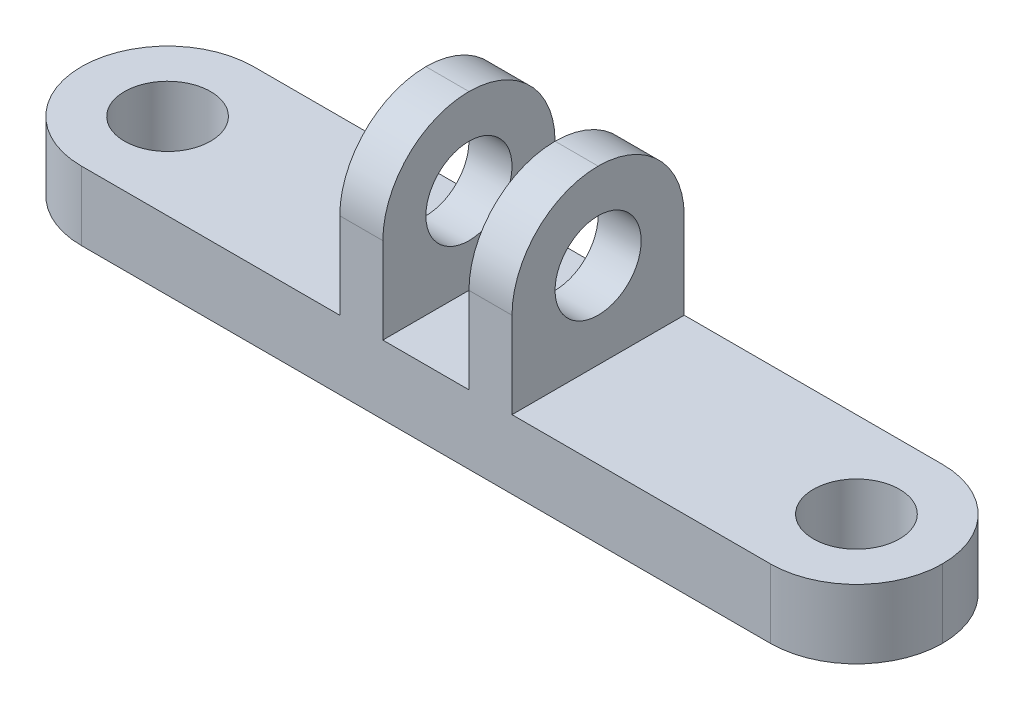
ISO-10303-21;
HEADER;
FILE_DESCRIPTION(('STEP AP214'),'2;1');
FILE_NAME('part.step','',(''),(''),'','','');
FILE_SCHEMA(('AUTOMOTIVE_DESIGN { 1 0 10303 214 1 1 1 1 }'));
ENDSEC;
DATA;
#1=APPLICATION_CONTEXT('core data for automotive mechanical design processes');
#2=APPLICATION_PROTOCOL_DEFINITION('international standard','automotive_design',2000,#1);
#3=PRODUCT_CONTEXT('',#1,'mechanical');
#4=PRODUCT('Part','Part','',(#3));
#5=PRODUCT_RELATED_PRODUCT_CATEGORY('part','',(#4));
#6=PRODUCT_DEFINITION_FORMATION('','',#4);
#7=PRODUCT_DEFINITION_CONTEXT('part definition',#1,'design');
#8=PRODUCT_DEFINITION('design','',#6,#7);
#9=PRODUCT_DEFINITION_SHAPE('','',#8);
#10=(LENGTH_UNIT() NAMED_UNIT(*) SI_UNIT(.MILLI.,.METRE.));
#11=(NAMED_UNIT(*) PLANE_ANGLE_UNIT() SI_UNIT($,.RADIAN.));
#12=(NAMED_UNIT(*) SI_UNIT($,.STERADIAN.) SOLID_ANGLE_UNIT());
#13=UNCERTAINTY_MEASURE_WITH_UNIT(LENGTH_MEASURE(1.E-05),#10,'distance_accuracy_value','');
#14=(GEOMETRIC_REPRESENTATION_CONTEXT(3) GLOBAL_UNCERTAINTY_ASSIGNED_CONTEXT((#13)) GLOBAL_UNIT_ASSIGNED_CONTEXT((#10,
#11,#12)) REPRESENTATION_CONTEXT('',''));
#15=CARTESIAN_POINT('',(0.,0.,0.));
#16=DIRECTION('',(0.,0.,1.));
#17=DIRECTION('',(1.,0.,0.));
#18=AXIS2_PLACEMENT_3D('',#15,#16,#17);
#19=CARTESIAN_POINT('',(0.,2.54,0.));
#20=DIRECTION('',(0.,-1.,0.));
#21=DIRECTION('',(0.,0.,-1.));
#22=AXIS2_PLACEMENT_3D('',#19,#20,#21);
#23=PLANE('',#22);
#24=CARTESIAN_POINT('',(12.7,2.54,0.));
#25=DIRECTION('',(0.,1.,0.));
#26=DIRECTION('',(0.,0.,1.));
#27=AXIS2_PLACEMENT_3D('',#24,#25,#26);
#28=CIRCLE('',#27,1.5875);
#29=CARTESIAN_POINT('',(12.7,2.54,1.5875));
#30=VERTEX_POINT('',#29);
#31=EDGE_CURVE('E228',#30,#30,#28,.T.);
#32=ORIENTED_EDGE('',*,*,#31,.F.);
#33=EDGE_LOOP('',(#32));
#34=FACE_BOUND('',#33,.T.);
#35=CARTESIAN_POINT('',(12.7,2.54,0.));
#36=DIRECTION('',(0.,-1.,0.));
#37=DIRECTION('',(0.,0.,-1.));
#38=AXIS2_PLACEMENT_3D('',#35,#36,#37);
#39=CIRCLE('',#38,3.175);
#40=CARTESIAN_POINT('',(12.7,2.54,3.175));
#41=VERTEX_POINT('',#40);
#42=CARTESIAN_POINT('',(15.875,2.54,0.));
#43=VERTEX_POINT('',#42);
#44=EDGE_CURVE('E306',#41,#43,#39,.F.);
#45=ORIENTED_EDGE('',*,*,#44,.T.);
#46=CARTESIAN_POINT('',(12.7,2.54,0.));
#47=DIRECTION('',(0.,-1.,0.));
#48=DIRECTION('',(0.,0.,-1.));
#49=AXIS2_PLACEMENT_3D('',#46,#47,#48);
#50=CIRCLE('',#49,3.175);
#51=CARTESIAN_POINT('',(12.7,2.54,-3.175));
#52=VERTEX_POINT('',#51);
#53=EDGE_CURVE('E309',#43,#52,#50,.F.);
#54=ORIENTED_EDGE('',*,*,#53,.T.);
#55=DIRECTION('',(-1.,0.,0.));
#56=VECTOR('',#55,1.);
#57=CARTESIAN_POINT('',(-15.875,2.54,-3.175));
#58=LINE('',#57,#56);
#59=CARTESIAN_POINT('',(3.175,2.54,-3.175));
#60=VERTEX_POINT('',#59);
#61=EDGE_CURVE('E184',#52,#60,#58,.T.);
#62=ORIENTED_EDGE('',*,*,#61,.T.);
#63=DIRECTION('',(0.,0.,-1.));
#64=VECTOR('',#63,1.);
#65=CARTESIAN_POINT('',(3.175,2.54,3.175));
#66=LINE('',#65,#64);
#67=CARTESIAN_POINT('',(3.175,2.54,3.175));
#68=VERTEX_POINT('',#67);
#69=EDGE_CURVE('E193',#68,#60,#66,.T.);
#70=ORIENTED_EDGE('',*,*,#69,.F.);
#71=DIRECTION('',(1.,0.,0.));
#72=VECTOR('',#71,1.);
#73=CARTESIAN_POINT('',(-15.875,2.54,3.175));
#74=LINE('',#73,#72);
#75=EDGE_CURVE('E246',#68,#41,#74,.T.);
#76=ORIENTED_EDGE('',*,*,#75,.T.);
#77=EDGE_LOOP('',(#45,#54,#62,#70,#76));
#78=FACE_BOUND('',#77,.T.);
#79=ADVANCED_FACE('F43',(#34,#78),#23,.F.);
#80=DIRECTION('',(0.,0.,1.));
#81=VECTOR('',#80,1.);
#82=CARTESIAN_POINT('',(1.5875,2.54,3.175));
#83=LINE('',#82,#81);
#84=CARTESIAN_POINT('',(1.5875,2.54,-3.175));
#85=VERTEX_POINT('',#84);
#86=CARTESIAN_POINT('',(1.5875,2.54,3.175));
#87=VERTEX_POINT('',#86);
#88=EDGE_CURVE('E165',#85,#87,#83,.T.);
#89=ORIENTED_EDGE('',*,*,#88,.F.);
#90=CARTESIAN_POINT('',(-1.5875,2.54,-3.175));
#91=VERTEX_POINT('',#90);
#92=EDGE_CURVE('E175',#85,#91,#58,.T.);
#93=ORIENTED_EDGE('',*,*,#92,.T.);
#94=DIRECTION('',(0.,0.,-1.));
#95=VECTOR('',#94,1.);
#96=CARTESIAN_POINT('',(-1.5875,2.54,3.175));
#97=LINE('',#96,#95);
#98=CARTESIAN_POINT('',(-1.5875,2.54,3.175));
#99=VERTEX_POINT('',#98);
#100=EDGE_CURVE('E208',#99,#91,#97,.T.);
#101=ORIENTED_EDGE('',*,*,#100,.F.);
#102=EDGE_CURVE('E190',#99,#87,#74,.T.);
#103=ORIENTED_EDGE('',*,*,#102,.T.);
#104=EDGE_LOOP('',(#89,#93,#101,#103));
#105=FACE_BOUND('',#104,.T.);
#106=ADVANCED_FACE('F188',(#105),#23,.F.);
#107=CARTESIAN_POINT('',(-12.7,2.54,0.));
#108=DIRECTION('',(0.,1.,0.));
#109=DIRECTION('',(0.,0.,1.));
#110=AXIS2_PLACEMENT_3D('',#107,#108,#109);
#111=CIRCLE('',#110,1.5875);
#112=CARTESIAN_POINT('',(-12.7,2.54,1.5875));
#113=VERTEX_POINT('',#112);
#114=EDGE_CURVE('E236',#113,#113,#111,.T.);
#115=ORIENTED_EDGE('',*,*,#114,.F.);
#116=EDGE_LOOP('',(#115));
#117=FACE_BOUND('',#116,.T.);
#118=CARTESIAN_POINT('',(-12.7,2.54,0.));
#119=DIRECTION('',(0.,-1.,0.));
#120=DIRECTION('',(0.,0.,-1.));
#121=AXIS2_PLACEMENT_3D('',#118,#119,#120);
#122=CIRCLE('',#121,3.175);
#123=CARTESIAN_POINT('',(-12.7,2.54,-3.175));
#124=VERTEX_POINT('',#123);
#125=CARTESIAN_POINT('',(-15.875,2.54,0.));
#126=VERTEX_POINT('',#125);
#127=EDGE_CURVE('E287',#124,#126,#122,.F.);
#128=ORIENTED_EDGE('',*,*,#127,.T.);
#129=CARTESIAN_POINT('',(-12.7,2.54,0.));
#130=DIRECTION('',(0.,-1.,0.));
#131=DIRECTION('',(0.,0.,-1.));
#132=AXIS2_PLACEMENT_3D('',#129,#130,#131);
#133=CIRCLE('',#132,3.175);
#134=CARTESIAN_POINT('',(-12.7,2.54,3.175));
#135=VERTEX_POINT('',#134);
#136=EDGE_CURVE('E290',#126,#135,#133,.F.);
#137=ORIENTED_EDGE('',*,*,#136,.T.);
#138=CARTESIAN_POINT('',(-3.175,2.54,3.175));
#139=VERTEX_POINT('',#138);
#140=EDGE_CURVE('E244',#135,#139,#74,.T.);
#141=ORIENTED_EDGE('',*,*,#140,.T.);
#142=DIRECTION('',(0.,0.,1.));
#143=VECTOR('',#142,1.);
#144=CARTESIAN_POINT('',(-3.175,2.54,3.175));
#145=LINE('',#144,#143);
#146=CARTESIAN_POINT('',(-3.175,2.54,-3.175));
#147=VERTEX_POINT('',#146);
#148=EDGE_CURVE('E211',#147,#139,#145,.T.);
#149=ORIENTED_EDGE('',*,*,#148,.F.);
#150=EDGE_CURVE('E185',#147,#124,#58,.T.);
#151=ORIENTED_EDGE('',*,*,#150,.T.);
#152=EDGE_LOOP('',(#128,#137,#141,#149,#151));
#153=FACE_BOUND('',#152,.T.);
#154=ADVANCED_FACE('F393',(#117,#153),#23,.F.);
#155=CARTESIAN_POINT('',(0.,0.,0.));
#156=DIRECTION('',(0.,-1.,0.));
#157=DIRECTION('',(0.,0.,-1.));
#158=AXIS2_PLACEMENT_3D('',#155,#156,#157);
#159=PLANE('',#158);
#160=CARTESIAN_POINT('',(-12.7,0.,0.));
#161=DIRECTION('',(0.,1.,0.));
#162=DIRECTION('',(0.,0.,1.));
#163=AXIS2_PLACEMENT_3D('',#160,#161,#162);
#164=CIRCLE('',#163,1.5875);
#165=CARTESIAN_POINT('',(-12.7,0.,1.5875));
#166=VERTEX_POINT('',#165);
#167=EDGE_CURVE('E232',#166,#166,#164,.T.);
#168=ORIENTED_EDGE('',*,*,#167,.T.);
#169=EDGE_LOOP('',(#168));
#170=FACE_BOUND('',#169,.T.);
#171=DIRECTION('',(1.,0.,0.));
#172=VECTOR('',#171,1.);
#173=CARTESIAN_POINT('',(-15.875,0.,3.175));
#174=LINE('',#173,#172);
#175=CARTESIAN_POINT('',(-12.7,0.,3.175));
#176=VERTEX_POINT('',#175);
#177=CARTESIAN_POINT('',(12.7,0.,3.175));
#178=VERTEX_POINT('',#177);
#179=EDGE_CURVE('E240',#176,#178,#174,.T.);
#180=ORIENTED_EDGE('',*,*,#179,.F.);
#181=CARTESIAN_POINT('',(-12.7,0.,0.));
#182=DIRECTION('',(0.,-1.,0.));
#183=DIRECTION('',(0.,0.,-1.));
#184=AXIS2_PLACEMENT_3D('',#181,#182,#183);
#185=CIRCLE('',#184,3.175);
#186=CARTESIAN_POINT('',(-15.875,0.,0.));
#187=VERTEX_POINT('',#186);
#188=EDGE_CURVE('E284',#176,#187,#185,.T.);
#189=ORIENTED_EDGE('',*,*,#188,.T.);
#190=CARTESIAN_POINT('',(-12.7,0.,0.));
#191=DIRECTION('',(0.,-1.,0.));
#192=DIRECTION('',(0.,0.,-1.));
#193=AXIS2_PLACEMENT_3D('',#190,#191,#192);
#194=CIRCLE('',#193,3.175);
#195=CARTESIAN_POINT('',(-12.7,0.,-3.175));
#196=VERTEX_POINT('',#195);
#197=EDGE_CURVE('E281',#187,#196,#194,.T.);
#198=ORIENTED_EDGE('',*,*,#197,.T.);
#199=DIRECTION('',(-1.,0.,0.));
#200=VECTOR('',#199,1.);
#201=CARTESIAN_POINT('',(-15.875,0.,-3.175));
#202=LINE('',#201,#200);
#203=CARTESIAN_POINT('',(12.7,0.,-3.175));
#204=VERTEX_POINT('',#203);
#205=EDGE_CURVE('E253',#204,#196,#202,.T.);
#206=ORIENTED_EDGE('',*,*,#205,.F.);
#207=CARTESIAN_POINT('',(12.7,0.,0.));
#208=DIRECTION('',(0.,-1.,0.));
#209=DIRECTION('',(0.,0.,-1.));
#210=AXIS2_PLACEMENT_3D('',#207,#208,#209);
#211=CIRCLE('',#210,3.175);
#212=CARTESIAN_POINT('',(15.875,0.,0.));
#213=VERTEX_POINT('',#212);
#214=EDGE_CURVE('E278',#204,#213,#211,.T.);
#215=ORIENTED_EDGE('',*,*,#214,.T.);
#216=CARTESIAN_POINT('',(12.7,0.,0.));
#217=DIRECTION('',(0.,-1.,0.));
#218=DIRECTION('',(0.,0.,-1.));
#219=AXIS2_PLACEMENT_3D('',#216,#217,#218);
#220=CIRCLE('',#219,3.175);
#221=EDGE_CURVE('E275',#213,#178,#220,.T.);
#222=ORIENTED_EDGE('',*,*,#221,.T.);
#223=EDGE_LOOP('',(#180,#189,#198,#206,#215,#222));
#224=FACE_BOUND('',#223,.T.);
#225=CARTESIAN_POINT('',(12.7,0.,0.));
#226=DIRECTION('',(0.,1.,0.));
#227=DIRECTION('',(0.,0.,1.));
#228=AXIS2_PLACEMENT_3D('',#225,#226,#227);
#229=CIRCLE('',#228,1.5875);
#230=CARTESIAN_POINT('',(12.7,0.,1.5875));
#231=VERTEX_POINT('',#230);
#232=EDGE_CURVE('E227',#231,#231,#229,.T.);
#233=ORIENTED_EDGE('',*,*,#232,.T.);
#234=EDGE_LOOP('',(#233));
#235=FACE_BOUND('',#234,.T.);
#236=ADVANCED_FACE('F401',(#170,#224,#235),#159,.T.);
#237=CARTESIAN_POINT('',(-15.875,2.54,3.175));
#238=DIRECTION('',(0.,0.,-1.));
#239=DIRECTION('',(-1.,0.,0.));
#240=AXIS2_PLACEMENT_3D('',#237,#238,#239);
#241=PLANE('',#240);
#242=ORIENTED_EDGE('',*,*,#140,.F.);
#243=DIRECTION('',(0.,-1.,0.));
#244=VECTOR('',#243,1.);
#245=CARTESIAN_POINT('',(-12.7,2.54,3.175));
#246=LINE('',#245,#244);
#247=EDGE_CURVE('E271',#135,#176,#246,.T.);
#248=ORIENTED_EDGE('',*,*,#247,.T.);
#249=ORIENTED_EDGE('',*,*,#179,.T.);
#250=DIRECTION('',(0.,-1.,0.));
#251=VECTOR('',#250,1.);
#252=CARTESIAN_POINT('',(12.7,2.54,3.175));
#253=LINE('',#252,#251);
#254=EDGE_CURVE('E268',#178,#41,#253,.F.);
#255=ORIENTED_EDGE('',*,*,#254,.T.);
#256=ORIENTED_EDGE('',*,*,#75,.F.);
#257=DIRECTION('',(0.,-1.,0.));
#258=VECTOR('',#257,1.);
#259=CARTESIAN_POINT('',(3.175,8.89,3.175));
#260=LINE('',#259,#258);
#261=CARTESIAN_POINT('',(3.175,5.715,3.175));
#262=VERTEX_POINT('',#261);
#263=EDGE_CURVE('E192',#262,#68,#260,.T.);
#264=ORIENTED_EDGE('',*,*,#263,.F.);
#265=DIRECTION('',(1.,0.,0.));
#266=VECTOR('',#265,1.);
#267=CARTESIAN_POINT('',(-15.875,5.715,3.175));
#268=LINE('',#267,#266);
#269=CARTESIAN_POINT('',(1.5875,5.715,3.175));
#270=VERTEX_POINT('',#269);
#271=EDGE_CURVE('E264',#262,#270,#268,.F.);
#272=ORIENTED_EDGE('',*,*,#271,.T.);
#273=DIRECTION('',(0.,-1.,0.));
#274=VECTOR('',#273,1.);
#275=CARTESIAN_POINT('',(1.5875,8.89,3.175));
#276=LINE('',#275,#274);
#277=EDGE_CURVE('E172',#270,#87,#276,.T.);
#278=ORIENTED_EDGE('',*,*,#277,.T.);
#279=ORIENTED_EDGE('',*,*,#102,.F.);
#280=DIRECTION('',(0.,-1.,0.));
#281=VECTOR('',#280,1.);
#282=CARTESIAN_POINT('',(-1.5875,8.89,3.175));
#283=LINE('',#282,#281);
#284=CARTESIAN_POINT('',(-1.5875,5.715,3.175));
#285=VERTEX_POINT('',#284);
#286=EDGE_CURVE('E215',#285,#99,#283,.T.);
#287=ORIENTED_EDGE('',*,*,#286,.F.);
#288=DIRECTION('',(1.,0.,0.));
#289=VECTOR('',#288,1.);
#290=CARTESIAN_POINT('',(-15.875,5.715,3.175));
#291=LINE('',#290,#289);
#292=CARTESIAN_POINT('',(-3.175,5.715,3.175));
#293=VERTEX_POINT('',#292);
#294=EDGE_CURVE('E249',#285,#293,#291,.F.);
#295=ORIENTED_EDGE('',*,*,#294,.T.);
#296=DIRECTION('',(0.,-1.,0.));
#297=VECTOR('',#296,1.);
#298=CARTESIAN_POINT('',(-3.175,8.89,3.175));
#299=LINE('',#298,#297);
#300=EDGE_CURVE('E218',#293,#139,#299,.T.);
#301=ORIENTED_EDGE('',*,*,#300,.T.);
#302=EDGE_LOOP('',(#242,#248,#249,#255,#256,#264,#272,#278,#279,#287,#295,#301));
#303=FACE_BOUND('',#302,.T.);
#304=ADVANCED_FACE('F354',(#303),#241,.F.);
#305=CARTESIAN_POINT('',(-15.875,2.54,-3.175));
#306=DIRECTION('',(0.,0.,1.));
#307=DIRECTION('',(1.,0.,0.));
#308=AXIS2_PLACEMENT_3D('',#305,#306,#307);
#309=PLANE('',#308);
#310=ORIENTED_EDGE('',*,*,#205,.T.);
#311=DIRECTION('',(0.,-1.,0.));
#312=VECTOR('',#311,1.);
#313=CARTESIAN_POINT('',(-12.7,2.54,-3.175));
#314=LINE('',#313,#312);
#315=EDGE_CURVE('E303',#196,#124,#314,.F.);
#316=ORIENTED_EDGE('',*,*,#315,.T.);
#317=ORIENTED_EDGE('',*,*,#150,.F.);
#318=DIRECTION('',(0.,-1.,0.));
#319=VECTOR('',#318,1.);
#320=CARTESIAN_POINT('',(-3.175,8.89,-3.175));
#321=LINE('',#320,#319);
#322=CARTESIAN_POINT('',(-3.175,5.715,-3.175));
#323=VERTEX_POINT('',#322);
#324=EDGE_CURVE('E222',#323,#147,#321,.T.);
#325=ORIENTED_EDGE('',*,*,#324,.F.);
#326=DIRECTION('',(-1.,0.,0.));
#327=VECTOR('',#326,1.);
#328=CARTESIAN_POINT('',(-15.875,5.715,-3.175));
#329=LINE('',#328,#327);
#330=CARTESIAN_POINT('',(-1.5875,5.715,-3.175));
#331=VERTEX_POINT('',#330);
#332=EDGE_CURVE('E293',#323,#331,#329,.F.);
#333=ORIENTED_EDGE('',*,*,#332,.T.);
#334=DIRECTION('',(0.,-1.,0.));
#335=VECTOR('',#334,1.);
#336=CARTESIAN_POINT('',(-1.5875,8.89,-3.175));
#337=LINE('',#336,#335);
#338=EDGE_CURVE('E179',#331,#91,#337,.T.);
#339=ORIENTED_EDGE('',*,*,#338,.T.);
#340=ORIENTED_EDGE('',*,*,#92,.F.);
#341=DIRECTION('',(0.,-1.,0.));
#342=VECTOR('',#341,1.);
#343=CARTESIAN_POINT('',(1.5875,8.89,-3.175));
#344=LINE('',#343,#342);
#345=CARTESIAN_POINT('',(1.5875,5.715,-3.175));
#346=VERTEX_POINT('',#345);
#347=EDGE_CURVE('E160',#346,#85,#344,.T.);
#348=ORIENTED_EDGE('',*,*,#347,.F.);
#349=DIRECTION('',(-1.,0.,0.));
#350=VECTOR('',#349,1.);
#351=CARTESIAN_POINT('',(-15.875,5.715,-3.175));
#352=LINE('',#351,#350);
#353=CARTESIAN_POINT('',(3.175,5.715,-3.175));
#354=VERTEX_POINT('',#353);
#355=EDGE_CURVE('E296',#346,#354,#352,.F.);
#356=ORIENTED_EDGE('',*,*,#355,.T.);
#357=DIRECTION('',(0.,-1.,0.));
#358=VECTOR('',#357,1.);
#359=CARTESIAN_POINT('',(3.175,8.89,-3.175));
#360=LINE('',#359,#358);
#361=EDGE_CURVE('E171',#354,#60,#360,.T.);
#362=ORIENTED_EDGE('',*,*,#361,.T.);
#363=ORIENTED_EDGE('',*,*,#61,.F.);
#364=DIRECTION('',(0.,-1.,0.));
#365=VECTOR('',#364,1.);
#366=CARTESIAN_POINT('',(12.7,2.54,-3.175));
#367=LINE('',#366,#365);
#368=EDGE_CURVE('E299',#52,#204,#367,.T.);
#369=ORIENTED_EDGE('',*,*,#368,.T.);
#370=EDGE_LOOP('',(#310,#316,#317,#325,#333,#339,#340,#348,#356,#362,#363,#369));
#371=FACE_BOUND('',#370,.T.);
#372=ADVANCED_FACE('F177',(#371),#309,.F.);
#373=CARTESIAN_POINT('',(-12.7,2.54,0.));
#374=DIRECTION('',(0.,-1.,0.));
#375=DIRECTION('',(0.,0.,-1.));
#376=AXIS2_PLACEMENT_3D('',#373,#374,#375);
#377=CYLINDRICAL_SURFACE('',#376,1.5875);
#378=ORIENTED_EDGE('',*,*,#114,.T.);
#379=EDGE_LOOP('',(#378));
#380=FACE_BOUND('',#379,.T.);
#381=ORIENTED_EDGE('',*,*,#167,.F.);
#382=EDGE_LOOP('',(#381));
#383=FACE_BOUND('',#382,.T.);
#384=ADVANCED_FACE('F444',(#380,#383),#377,.F.);
#385=CARTESIAN_POINT('',(12.7,2.54,0.));
#386=DIRECTION('',(0.,-1.,0.));
#387=DIRECTION('',(0.,0.,-1.));
#388=AXIS2_PLACEMENT_3D('',#385,#386,#387);
#389=CYLINDRICAL_SURFACE('',#388,1.5875);
#390=ORIENTED_EDGE('',*,*,#31,.T.);
#391=EDGE_LOOP('',(#390));
#392=FACE_BOUND('',#391,.T.);
#393=ORIENTED_EDGE('',*,*,#232,.F.);
#394=EDGE_LOOP('',(#393));
#395=FACE_BOUND('',#394,.T.);
#396=ADVANCED_FACE('F437',(#392,#395),#389,.F.);
#397=CARTESIAN_POINT('',(-1.5875,8.89,3.175));
#398=DIRECTION('',(-1.,0.,0.));
#399=DIRECTION('',(0.,0.,1.));
#400=AXIS2_PLACEMENT_3D('',#397,#398,#399);
#401=PLANE('',#400);
#402=CARTESIAN_POINT('',(-1.5875,5.715,0.));
#403=DIRECTION('',(-1.,0.,0.));
#404=DIRECTION('',(0.,0.,1.));
#405=AXIS2_PLACEMENT_3D('',#402,#403,#404);
#406=CIRCLE('',#405,1.5875);
#407=CARTESIAN_POINT('',(-1.5875,5.715,1.5875));
#408=VERTEX_POINT('',#407);
#409=EDGE_CURVE('E199',#408,#408,#406,.T.);
#410=ORIENTED_EDGE('',*,*,#409,.T.);
#411=EDGE_LOOP('',(#410));
#412=FACE_BOUND('',#411,.T.);
#413=ORIENTED_EDGE('',*,*,#338,.F.);
#414=CARTESIAN_POINT('',(-1.5875,5.715,0.));
#415=DIRECTION('',(-1.,0.,0.));
#416=DIRECTION('',(0.,0.,1.));
#417=AXIS2_PLACEMENT_3D('',#414,#415,#416);
#418=CIRCLE('',#417,3.175);
#419=CARTESIAN_POINT('',(-1.5875,8.89,0.));
#420=VERTEX_POINT('',#419);
#421=EDGE_CURVE('E11',#331,#420,#418,.F.);
#422=ORIENTED_EDGE('',*,*,#421,.T.);
#423=CARTESIAN_POINT('',(-1.5875,5.715,0.));
#424=DIRECTION('',(-1.,0.,0.));
#425=DIRECTION('',(0.,0.,1.));
#426=AXIS2_PLACEMENT_3D('',#423,#424,#425);
#427=CIRCLE('',#426,3.175);
#428=EDGE_CURVE('E53',#420,#285,#427,.F.);
#429=ORIENTED_EDGE('',*,*,#428,.T.);
#430=ORIENTED_EDGE('',*,*,#286,.T.);
#431=ORIENTED_EDGE('',*,*,#100,.T.);
#432=EDGE_LOOP('',(#413,#422,#429,#430,#431));
#433=FACE_BOUND('',#432,.T.);
#434=ADVANCED_FACE('F351',(#412,#433),#401,.F.);
#435=CARTESIAN_POINT('',(-3.175,8.89,3.175));
#436=DIRECTION('',(1.,0.,0.));
#437=DIRECTION('',(0.,0.,-1.));
#438=AXIS2_PLACEMENT_3D('',#435,#436,#437);
#439=PLANE('',#438);
#440=CARTESIAN_POINT('',(-3.175,5.715,0.));
#441=DIRECTION('',(1.,0.,0.));
#442=DIRECTION('',(0.,0.,-1.));
#443=AXIS2_PLACEMENT_3D('',#440,#441,#442);
#444=CIRCLE('',#443,1.5875);
#445=CARTESIAN_POINT('',(-3.175,5.715,-1.5875));
#446=VERTEX_POINT('',#445);
#447=EDGE_CURVE('E617',#446,#446,#444,.T.);
#448=ORIENTED_EDGE('',*,*,#447,.T.);
#449=EDGE_LOOP('',(#448));
#450=FACE_BOUND('',#449,.T.);
#451=CARTESIAN_POINT('',(-3.175,5.715,0.));
#452=DIRECTION('',(1.,0.,0.));
#453=DIRECTION('',(0.,0.,-1.));
#454=AXIS2_PLACEMENT_3D('',#451,#452,#453);
#455=CIRCLE('',#454,3.175);
#456=CARTESIAN_POINT('',(-3.175,8.89,0.));
#457=VERTEX_POINT('',#456);
#458=EDGE_CURVE('E67',#293,#457,#455,.F.);
#459=ORIENTED_EDGE('',*,*,#458,.T.);
#460=CARTESIAN_POINT('',(-3.175,5.715,0.));
#461=DIRECTION('',(1.,0.,0.));
#462=DIRECTION('',(0.,0.,-1.));
#463=AXIS2_PLACEMENT_3D('',#460,#461,#462);
#464=CIRCLE('',#463,3.175);
#465=EDGE_CURVE('E325',#457,#323,#464,.F.);
#466=ORIENTED_EDGE('',*,*,#465,.T.);
#467=ORIENTED_EDGE('',*,*,#324,.T.);
#468=ORIENTED_EDGE('',*,*,#148,.T.);
#469=ORIENTED_EDGE('',*,*,#300,.F.);
#470=EDGE_LOOP('',(#459,#466,#467,#468,#469));
#471=FACE_BOUND('',#470,.T.);
#472=ADVANCED_FACE('F427',(#450,#471),#439,.F.);
#473=CARTESIAN_POINT('',(3.175,8.89,3.175));
#474=DIRECTION('',(-1.,0.,0.));
#475=DIRECTION('',(0.,0.,1.));
#476=AXIS2_PLACEMENT_3D('',#473,#474,#475);
#477=PLANE('',#476);
#478=CARTESIAN_POINT('',(3.175,5.715,0.));
#479=DIRECTION('',(-1.,0.,0.));
#480=DIRECTION('',(0.,0.,1.));
#481=AXIS2_PLACEMENT_3D('',#478,#479,#480);
#482=CIRCLE('',#481,1.5875);
#483=CARTESIAN_POINT('',(3.175,5.715,1.5875));
#484=VERTEX_POINT('',#483);
#485=EDGE_CURVE('E260',#484,#484,#482,.T.);
#486=ORIENTED_EDGE('',*,*,#485,.T.);
#487=EDGE_LOOP('',(#486));
#488=FACE_BOUND('',#487,.T.);
#489=CARTESIAN_POINT('',(3.175,5.715,0.));
#490=DIRECTION('',(-1.,0.,0.));
#491=DIRECTION('',(0.,0.,1.));
#492=AXIS2_PLACEMENT_3D('',#489,#490,#491);
#493=CIRCLE('',#492,3.175);
#494=CARTESIAN_POINT('',(3.175,8.89,0.));
#495=VERTEX_POINT('',#494);
#496=EDGE_CURVE('E312',#354,#495,#493,.F.);
#497=ORIENTED_EDGE('',*,*,#496,.T.);
#498=CARTESIAN_POINT('',(3.175,5.715,0.));
#499=DIRECTION('',(-1.,0.,0.));
#500=DIRECTION('',(0.,0.,1.));
#501=AXIS2_PLACEMENT_3D('',#498,#499,#500);
#502=CIRCLE('',#501,3.175);
#503=EDGE_CURVE('E315',#495,#262,#502,.F.);
#504=ORIENTED_EDGE('',*,*,#503,.T.);
#505=ORIENTED_EDGE('',*,*,#263,.T.);
#506=ORIENTED_EDGE('',*,*,#69,.T.);
#507=ORIENTED_EDGE('',*,*,#361,.F.);
#508=EDGE_LOOP('',(#497,#504,#505,#506,#507));
#509=FACE_BOUND('',#508,.T.);
#510=ADVANCED_FACE('F377',(#488,#509),#477,.F.);
#511=CARTESIAN_POINT('',(1.5875,8.89,3.175));
#512=DIRECTION('',(1.,0.,0.));
#513=DIRECTION('',(0.,0.,-1.));
#514=AXIS2_PLACEMENT_3D('',#511,#512,#513);
#515=PLANE('',#514);
#516=CARTESIAN_POINT('',(1.5875,5.715,0.));
#517=DIRECTION('',(1.,0.,0.));
#518=DIRECTION('',(0.,0.,-1.));
#519=AXIS2_PLACEMENT_3D('',#516,#517,#518);
#520=CIRCLE('',#519,1.5875);
#521=CARTESIAN_POINT('',(1.5875,5.715,-1.5875));
#522=VERTEX_POINT('',#521);
#523=EDGE_CURVE('E256',#522,#522,#520,.T.);
#524=ORIENTED_EDGE('',*,*,#523,.T.);
#525=EDGE_LOOP('',(#524));
#526=FACE_BOUND('',#525,.T.);
#527=ORIENTED_EDGE('',*,*,#277,.F.);
#528=CARTESIAN_POINT('',(1.5875,5.715,0.));
#529=DIRECTION('',(1.,0.,0.));
#530=DIRECTION('',(0.,0.,-1.));
#531=AXIS2_PLACEMENT_3D('',#528,#529,#530);
#532=CIRCLE('',#531,3.175);
#533=CARTESIAN_POINT('',(1.5875,8.89,0.));
#534=VERTEX_POINT('',#533);
#535=EDGE_CURVE('E320',#270,#534,#532,.F.);
#536=ORIENTED_EDGE('',*,*,#535,.T.);
#537=CARTESIAN_POINT('',(1.5875,5.715,0.));
#538=DIRECTION('',(1.,0.,0.));
#539=DIRECTION('',(0.,0.,-1.));
#540=AXIS2_PLACEMENT_3D('',#537,#538,#539);
#541=CIRCLE('',#540,3.175);
#542=EDGE_CURVE('E167',#534,#346,#541,.F.);
#543=ORIENTED_EDGE('',*,*,#542,.T.);
#544=ORIENTED_EDGE('',*,*,#347,.T.);
#545=ORIENTED_EDGE('',*,*,#88,.T.);
#546=EDGE_LOOP('',(#527,#536,#543,#544,#545));
#547=FACE_BOUND('',#546,.T.);
#548=ADVANCED_FACE('F163',(#526,#547),#515,.F.);
#549=CARTESIAN_POINT('',(-15.875,5.715,0.));
#550=DIRECTION('',(1.,0.,0.));
#551=DIRECTION('',(0.,0.,-1.));
#552=AXIS2_PLACEMENT_3D('',#549,#550,#551);
#553=CYLINDRICAL_SURFACE('',#552,1.5875);
#554=ORIENTED_EDGE('',*,*,#523,.F.);
#555=EDGE_LOOP('',(#554));
#556=FACE_BOUND('',#555,.T.);
#557=ORIENTED_EDGE('',*,*,#485,.F.);
#558=EDGE_LOOP('',(#557));
#559=FACE_BOUND('',#558,.T.);
#560=ADVANCED_FACE('F538',(#556,#559),#553,.F.);
#561=ORIENTED_EDGE('',*,*,#447,.F.);
#562=EDGE_LOOP('',(#561));
#563=FACE_BOUND('',#562,.T.);
#564=ORIENTED_EDGE('',*,*,#409,.F.);
#565=EDGE_LOOP('',(#564));
#566=FACE_BOUND('',#565,.T.);
#567=ADVANCED_FACE('F462',(#563,#566),#553,.F.);
#568=CARTESIAN_POINT('',(-12.7,2.54,0.));
#569=DIRECTION('',(0.,-1.,0.));
#570=DIRECTION('',(0.,0.,-1.));
#571=AXIS2_PLACEMENT_3D('',#568,#569,#570);
#572=CYLINDRICAL_SURFACE('',#571,3.175);
#573=DIRECTION('',(0.,-1.,0.));
#574=VECTOR('',#573,1.);
#575=CARTESIAN_POINT('',(-15.875,2.54,0.));
#576=LINE('',#575,#574);
#577=EDGE_CURVE('E261',#126,#187,#576,.T.);
#578=ORIENTED_EDGE('',*,*,#577,.F.);
#579=ORIENTED_EDGE('',*,*,#127,.F.);
#580=ORIENTED_EDGE('',*,*,#315,.F.);
#581=ORIENTED_EDGE('',*,*,#197,.F.);
#582=EDGE_LOOP('',(#578,#579,#580,#581));
#583=FACE_BOUND('',#582,.T.);
#584=ADVANCED_FACE('F418',(#583),#572,.T.);
#585=CARTESIAN_POINT('',(-12.7,2.54,0.));
#586=DIRECTION('',(0.,-1.,0.));
#587=DIRECTION('',(0.,0.,-1.));
#588=AXIS2_PLACEMENT_3D('',#585,#586,#587);
#589=CYLINDRICAL_SURFACE('',#588,3.175);
#590=ORIENTED_EDGE('',*,*,#136,.F.);
#591=ORIENTED_EDGE('',*,*,#577,.T.);
#592=ORIENTED_EDGE('',*,*,#188,.F.);
#593=ORIENTED_EDGE('',*,*,#247,.F.);
#594=EDGE_LOOP('',(#590,#591,#592,#593));
#595=FACE_BOUND('',#594,.T.);
#596=ADVANCED_FACE('F421',(#595),#589,.T.);
#597=CARTESIAN_POINT('',(12.7,2.54,0.));
#598=DIRECTION('',(0.,-1.,0.));
#599=DIRECTION('',(0.,0.,-1.));
#600=AXIS2_PLACEMENT_3D('',#597,#598,#599);
#601=CYLINDRICAL_SURFACE('',#600,3.175);
#602=DIRECTION('',(0.,-1.,0.));
#603=VECTOR('',#602,1.);
#604=CARTESIAN_POINT('',(15.875,2.54,0.));
#605=LINE('',#604,#603);
#606=EDGE_CURVE('E333',#43,#213,#605,.T.);
#607=ORIENTED_EDGE('',*,*,#606,.F.);
#608=ORIENTED_EDGE('',*,*,#44,.F.);
#609=ORIENTED_EDGE('',*,*,#254,.F.);
#610=ORIENTED_EDGE('',*,*,#221,.F.);
#611=EDGE_LOOP('',(#607,#608,#609,#610));
#612=FACE_BOUND('',#611,.T.);
#613=ADVANCED_FACE('F366',(#612),#601,.T.);
#614=CARTESIAN_POINT('',(12.7,2.54,0.));
#615=DIRECTION('',(0.,-1.,0.));
#616=DIRECTION('',(0.,0.,-1.));
#617=AXIS2_PLACEMENT_3D('',#614,#615,#616);
#618=CYLINDRICAL_SURFACE('',#617,3.175);
#619=ORIENTED_EDGE('',*,*,#53,.F.);
#620=ORIENTED_EDGE('',*,*,#606,.T.);
#621=ORIENTED_EDGE('',*,*,#214,.F.);
#622=ORIENTED_EDGE('',*,*,#368,.F.);
#623=EDGE_LOOP('',(#619,#620,#621,#622));
#624=FACE_BOUND('',#623,.T.);
#625=ADVANCED_FACE('F371',(#624),#618,.T.);
#626=CARTESIAN_POINT('',(0.,5.715,0.));
#627=DIRECTION('',(-1.,0.,0.));
#628=DIRECTION('',(0.,0.,1.));
#629=AXIS2_PLACEMENT_3D('',#626,#627,#628);
#630=CYLINDRICAL_SURFACE('',#629,3.175);
#631=ORIENTED_EDGE('',*,*,#355,.F.);
#632=ORIENTED_EDGE('',*,*,#542,.F.);
#633=DIRECTION('',(-1.,0.,0.));
#634=VECTOR('',#633,1.);
#635=CARTESIAN_POINT('',(0.,8.89,0.));
#636=LINE('',#635,#634);
#637=EDGE_CURVE('E336',#495,#534,#636,.T.);
#638=ORIENTED_EDGE('',*,*,#637,.F.);
#639=ORIENTED_EDGE('',*,*,#496,.F.);
#640=EDGE_LOOP('',(#631,#632,#638,#639));
#641=FACE_BOUND('',#640,.T.);
#642=ADVANCED_FACE('F381',(#641),#630,.T.);
#643=CARTESIAN_POINT('',(0.,5.715,0.));
#644=DIRECTION('',(1.,0.,0.));
#645=DIRECTION('',(0.,0.,-1.));
#646=AXIS2_PLACEMENT_3D('',#643,#644,#645);
#647=CYLINDRICAL_SURFACE('',#646,3.175);
#648=ORIENTED_EDGE('',*,*,#535,.F.);
#649=ORIENTED_EDGE('',*,*,#271,.F.);
#650=ORIENTED_EDGE('',*,*,#503,.F.);
#651=ORIENTED_EDGE('',*,*,#637,.T.);
#652=EDGE_LOOP('',(#648,#649,#650,#651));
#653=FACE_BOUND('',#652,.T.);
#654=ADVANCED_FACE('F379',(#653),#647,.T.);
#655=CARTESIAN_POINT('',(0.,5.715,0.));
#656=DIRECTION('',(1.,0.,0.));
#657=DIRECTION('',(0.,0.,-1.));
#658=AXIS2_PLACEMENT_3D('',#655,#656,#657);
#659=CYLINDRICAL_SURFACE('',#658,3.175);
#660=ORIENTED_EDGE('',*,*,#294,.F.);
#661=ORIENTED_EDGE('',*,*,#428,.F.);
#662=DIRECTION('',(1.,0.,0.));
#663=VECTOR('',#662,1.);
#664=CARTESIAN_POINT('',(0.,8.89,0.));
#665=LINE('',#664,#663);
#666=EDGE_CURVE('E47',#457,#420,#665,.T.);
#667=ORIENTED_EDGE('',*,*,#666,.F.);
#668=ORIENTED_EDGE('',*,*,#458,.F.);
#669=EDGE_LOOP('',(#660,#661,#667,#668));
#670=FACE_BOUND('',#669,.T.);
#671=ADVANCED_FACE('F45',(#670),#659,.T.);
#672=CARTESIAN_POINT('',(0.,5.715,0.));
#673=DIRECTION('',(-1.,0.,0.));
#674=DIRECTION('',(0.,0.,1.));
#675=AXIS2_PLACEMENT_3D('',#672,#673,#674);
#676=CYLINDRICAL_SURFACE('',#675,3.175);
#677=ORIENTED_EDGE('',*,*,#421,.F.);
#678=ORIENTED_EDGE('',*,*,#332,.F.);
#679=ORIENTED_EDGE('',*,*,#465,.F.);
#680=ORIENTED_EDGE('',*,*,#666,.T.);
#681=EDGE_LOOP('',(#677,#678,#679,#680));
#682=FACE_BOUND('',#681,.T.);
#683=ADVANCED_FACE('F346',(#682),#676,.T.);
#684=CLOSED_SHELL('',(#79,#106,#154,#236,#304,#372,#384,#396,#434,#472,#510,#548,#560,#567,#584,
#596,#613,#625,#642,#654,#671,#683));
#685=MANIFOLD_SOLID_BREP('B2',#684);
#686=ADVANCED_BREP_SHAPE_REPRESENTATION('',(#18,#685),#14);
#687=SHAPE_DEFINITION_REPRESENTATION(#9,#686);
ENDSEC;
END-ISO-10303-21;
